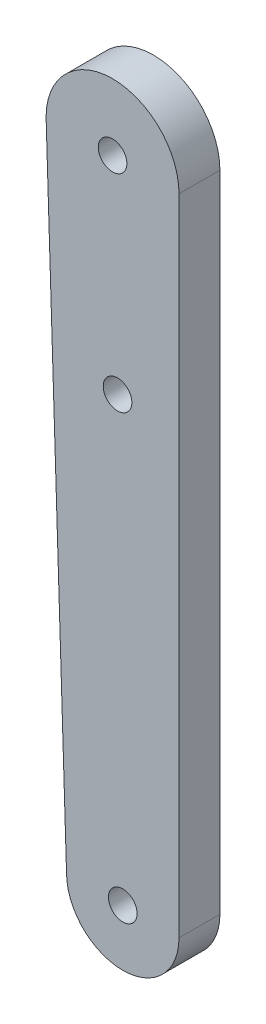
ISO-10303-21;
HEADER;
FILE_DESCRIPTION(('STEP AP214'),'2;1');
FILE_NAME('part.step','',(''),(''),'','','');
FILE_SCHEMA(('AUTOMOTIVE_DESIGN { 1 0 10303 214 1 1 1 1 }'));
ENDSEC;
DATA;
#1=APPLICATION_CONTEXT('core data for automotive mechanical design processes');
#2=APPLICATION_PROTOCOL_DEFINITION('international standard','automotive_design',2000,#1);
#3=PRODUCT_CONTEXT('',#1,'mechanical');
#4=PRODUCT('Part','Part','',(#3));
#5=PRODUCT_RELATED_PRODUCT_CATEGORY('part','',(#4));
#6=PRODUCT_DEFINITION_FORMATION('','',#4);
#7=PRODUCT_DEFINITION_CONTEXT('part definition',#1,'design');
#8=PRODUCT_DEFINITION('design','',#6,#7);
#9=PRODUCT_DEFINITION_SHAPE('','',#8);
#10=(LENGTH_UNIT() NAMED_UNIT(*) SI_UNIT(.MILLI.,.METRE.));
#11=(NAMED_UNIT(*) PLANE_ANGLE_UNIT() SI_UNIT($,.RADIAN.));
#12=(NAMED_UNIT(*) SI_UNIT($,.STERADIAN.) SOLID_ANGLE_UNIT());
#13=UNCERTAINTY_MEASURE_WITH_UNIT(LENGTH_MEASURE(1.E-05),#10,'distance_accuracy_value','');
#14=(GEOMETRIC_REPRESENTATION_CONTEXT(3) GLOBAL_UNCERTAINTY_ASSIGNED_CONTEXT((#13)) GLOBAL_UNIT_ASSIGNED_CONTEXT((#10,
#11,#12)) REPRESENTATION_CONTEXT('',''));
#15=CARTESIAN_POINT('',(0.,0.,0.));
#16=DIRECTION('',(0.,0.,1.));
#17=DIRECTION('',(1.,0.,0.));
#18=AXIS2_PLACEMENT_3D('',#15,#16,#17);
#19=CARTESIAN_POINT('',(-5.50068845938102,1.99331729577746,4.));
#20=DIRECTION('',(0.,0.,1.));
#21=DIRECTION('',(1.,0.,0.));
#22=AXIS2_PLACEMENT_3D('',#19,#20,#21);
#23=PLANE('',#22);
#24=CARTESIAN_POINT('',(-5.50068845938102,1.99331729577746,4.));
#25=DIRECTION('',(0.,0.,1.));
#26=DIRECTION('',(1.,0.,0.));
#27=AXIS2_PLACEMENT_3D('',#24,#25,#26);
#28=CIRCLE('',#27,1.4);
#29=CARTESIAN_POINT('',(-4.10068845938102,1.99331729577746,4.));
#30=VERTEX_POINT('',#29);
#31=EDGE_CURVE('E118',#30,#30,#28,.T.);
#32=ORIENTED_EDGE('',*,*,#31,.F.);
#33=EDGE_LOOP('',(#32));
#34=FACE_BOUND('',#33,.T.);
#35=CARTESIAN_POINT('',(-5.50068845938102,1.99331729577746,4.));
#36=DIRECTION('',(0.,0.,1.));
#37=DIRECTION('',(1.,0.,0.));
#38=AXIS2_PLACEMENT_3D('',#35,#36,#37);
#39=CIRCLE('',#38,5.5);
#40=CARTESIAN_POINT('',(-11.000688459381,1.99331729577745,4.));
#41=VERTEX_POINT('',#40);
#42=CARTESIAN_POINT('',(-0.000688459381021567,1.99331729577744,4.));
#43=VERTEX_POINT('',#42);
#44=EDGE_CURVE('E88',#41,#43,#39,.T.);
#45=ORIENTED_EDGE('',*,*,#44,.T.);
#46=DIRECTION('',(0.,1.,0.));
#47=VECTOR('',#46,1.);
#48=CARTESIAN_POINT('',(-0.000688459381021567,1.99331729577744,4.));
#49=LINE('',#48,#47);
#50=CARTESIAN_POINT('',(-0.000688459380886186,65.0160917207258,4.));
#51=VERTEX_POINT('',#50);
#52=EDGE_CURVE('E83',#43,#51,#49,.T.);
#53=ORIENTED_EDGE('',*,*,#52,.T.);
#54=CARTESIAN_POINT('',(-6.50068845938089,65.0160917207258,4.));
#55=DIRECTION('',(0.,0.,1.));
#56=DIRECTION('',(1.,0.,0.));
#57=AXIS2_PLACEMENT_3D('',#54,#55,#56);
#58=CIRCLE('',#57,6.5);
#59=CARTESIAN_POINT('',(-13.0006884593809,65.0160917207258,4.));
#60=VERTEX_POINT('',#59);
#61=EDGE_CURVE('E86',#51,#60,#58,.T.);
#62=ORIENTED_EDGE('',*,*,#61,.T.);
#63=DIRECTION('',(0.0317185921435704,-0.999496838870654,0.));
#64=VECTOR('',#63,1.);
#65=CARTESIAN_POINT('',(-13.0006884593809,65.0160917207258,4.));
#66=LINE('',#65,#64);
#67=EDGE_CURVE('E53',#60,#41,#66,.T.);
#68=ORIENTED_EDGE('',*,*,#67,.T.);
#69=EDGE_LOOP('',(#45,#53,#62,#68));
#70=FACE_BOUND('',#69,.T.);
#71=CARTESIAN_POINT('',(-6.50068845938089,65.0160917207258,4.));
#72=DIRECTION('',(0.,0.,1.));
#73=DIRECTION('',(1.,0.,0.));
#74=AXIS2_PLACEMENT_3D('',#71,#72,#73);
#75=CIRCLE('',#74,1.4);
#76=CARTESIAN_POINT('',(-5.10068845938089,65.0160917207258,4.));
#77=VERTEX_POINT('',#76);
#78=EDGE_CURVE('E103',#77,#77,#75,.T.);
#79=ORIENTED_EDGE('',*,*,#78,.F.);
#80=EDGE_LOOP('',(#79));
#81=FACE_BOUND('',#80,.T.);
#82=CARTESIAN_POINT('',(-6.01275635098238,45.0160917207258,4.));
#83=DIRECTION('',(0.,0.,1.));
#84=DIRECTION('',(1.,0.,0.));
#85=AXIS2_PLACEMENT_3D('',#82,#83,#84);
#86=CIRCLE('',#85,1.4);
#87=CARTESIAN_POINT('',(-4.61275635098238,45.0160917207258,4.));
#88=VERTEX_POINT('',#87);
#89=EDGE_CURVE('E124',#88,#88,#86,.T.);
#90=ORIENTED_EDGE('',*,*,#89,.F.);
#91=EDGE_LOOP('',(#90));
#92=FACE_BOUND('',#91,.T.);
#93=ADVANCED_FACE('F36',(#34,#70,#81,#92),#23,.T.);
#94=CARTESIAN_POINT('',(-5.50068845938102,1.99331729577746,0.));
#95=DIRECTION('',(0.,0.,1.));
#96=DIRECTION('',(1.,0.,0.));
#97=AXIS2_PLACEMENT_3D('',#94,#95,#96);
#98=PLANE('',#97);
#99=CARTESIAN_POINT('',(-5.50068845938102,1.99331729577746,0.));
#100=DIRECTION('',(0.,0.,1.));
#101=DIRECTION('',(1.,0.,0.));
#102=AXIS2_PLACEMENT_3D('',#99,#100,#101);
#103=CIRCLE('',#102,5.5);
#104=CARTESIAN_POINT('',(-11.000688459381,1.99331729577745,0.));
#105=VERTEX_POINT('',#104);
#106=CARTESIAN_POINT('',(-0.000688459381021567,1.99331729577744,0.));
#107=VERTEX_POINT('',#106);
#108=EDGE_CURVE('E100',#105,#107,#103,.T.);
#109=ORIENTED_EDGE('',*,*,#108,.F.);
#110=DIRECTION('',(0.0317185921435704,-0.999496838870654,0.));
#111=VECTOR('',#110,1.);
#112=CARTESIAN_POINT('',(-13.0006884593809,65.0160917207258,0.));
#113=LINE('',#112,#111);
#114=CARTESIAN_POINT('',(-13.0006884593809,65.0160917207258,0.));
#115=VERTEX_POINT('',#114);
#116=EDGE_CURVE('E76',#115,#105,#113,.T.);
#117=ORIENTED_EDGE('',*,*,#116,.F.);
#118=CARTESIAN_POINT('',(-6.50068845938089,65.0160917207258,0.));
#119=DIRECTION('',(0.,0.,1.));
#120=DIRECTION('',(1.,0.,0.));
#121=AXIS2_PLACEMENT_3D('',#118,#119,#120);
#122=CIRCLE('',#121,6.5);
#123=CARTESIAN_POINT('',(-0.000688459380886186,65.0160917207258,0.));
#124=VERTEX_POINT('',#123);
#125=EDGE_CURVE('E70',#124,#115,#122,.T.);
#126=ORIENTED_EDGE('',*,*,#125,.F.);
#127=DIRECTION('',(0.,1.,0.));
#128=VECTOR('',#127,1.);
#129=CARTESIAN_POINT('',(-0.000688459381021567,1.99331729577744,0.));
#130=LINE('',#129,#128);
#131=EDGE_CURVE('E92',#107,#124,#130,.T.);
#132=ORIENTED_EDGE('',*,*,#131,.F.);
#133=EDGE_LOOP('',(#109,#117,#126,#132));
#134=FACE_BOUND('',#133,.T.);
#135=CARTESIAN_POINT('',(-6.50068845938089,65.0160917207258,0.));
#136=DIRECTION('',(0.,0.,1.));
#137=DIRECTION('',(1.,0.,0.));
#138=AXIS2_PLACEMENT_3D('',#135,#136,#137);
#139=CIRCLE('',#138,1.4);
#140=CARTESIAN_POINT('',(-5.10068845938089,65.0160917207258,0.));
#141=VERTEX_POINT('',#140);
#142=EDGE_CURVE('E115',#141,#141,#139,.T.);
#143=ORIENTED_EDGE('',*,*,#142,.T.);
#144=EDGE_LOOP('',(#143));
#145=FACE_BOUND('',#144,.T.);
#146=CARTESIAN_POINT('',(-5.50068845938102,1.99331729577746,0.));
#147=DIRECTION('',(0.,0.,1.));
#148=DIRECTION('',(1.,0.,0.));
#149=AXIS2_PLACEMENT_3D('',#146,#147,#148);
#150=CIRCLE('',#149,1.4);
#151=CARTESIAN_POINT('',(-4.10068845938102,1.99331729577746,0.));
#152=VERTEX_POINT('',#151);
#153=EDGE_CURVE('E121',#152,#152,#150,.T.);
#154=ORIENTED_EDGE('',*,*,#153,.T.);
#155=EDGE_LOOP('',(#154));
#156=FACE_BOUND('',#155,.T.);
#157=CARTESIAN_POINT('',(-6.01275635098238,45.0160917207258,0.));
#158=DIRECTION('',(0.,0.,1.));
#159=DIRECTION('',(1.,0.,0.));
#160=AXIS2_PLACEMENT_3D('',#157,#158,#159);
#161=CIRCLE('',#160,1.4);
#162=CARTESIAN_POINT('',(-4.61275635098238,45.0160917207258,0.));
#163=VERTEX_POINT('',#162);
#164=EDGE_CURVE('E127',#163,#163,#161,.T.);
#165=ORIENTED_EDGE('',*,*,#164,.T.);
#166=EDGE_LOOP('',(#165));
#167=FACE_BOUND('',#166,.T.);
#168=ADVANCED_FACE('F111',(#134,#145,#156,#167),#98,.F.);
#169=CARTESIAN_POINT('',(-5.50068845938102,1.99331729577746,4.));
#170=DIRECTION('',(0.,0.,-1.));
#171=DIRECTION('',(-1.,0.,0.));
#172=AXIS2_PLACEMENT_3D('',#169,#170,#171);
#173=CYLINDRICAL_SURFACE('',#172,5.5);
#174=ORIENTED_EDGE('',*,*,#108,.T.);
#175=DIRECTION('',(0.,0.,-1.));
#176=VECTOR('',#175,1.);
#177=CARTESIAN_POINT('',(-0.000688459381021567,1.99331729577744,4.));
#178=LINE('',#177,#176);
#179=EDGE_CURVE('E11',#43,#107,#178,.T.);
#180=ORIENTED_EDGE('',*,*,#179,.F.);
#181=ORIENTED_EDGE('',*,*,#44,.F.);
#182=DIRECTION('',(0.,0.,-1.));
#183=VECTOR('',#182,1.);
#184=CARTESIAN_POINT('',(-11.000688459381,1.99331729577745,4.));
#185=LINE('',#184,#183);
#186=EDGE_CURVE('E96',#41,#105,#185,.T.);
#187=ORIENTED_EDGE('',*,*,#186,.T.);
#188=EDGE_LOOP('',(#174,#180,#181,#187));
#189=FACE_BOUND('',#188,.T.);
#190=ADVANCED_FACE('F38',(#189),#173,.T.);
#191=CARTESIAN_POINT('',(-0.000688459381021567,1.99331729577744,4.));
#192=DIRECTION('',(-1.,0.,0.));
#193=DIRECTION('',(0.,-1.,0.));
#194=AXIS2_PLACEMENT_3D('',#191,#192,#193);
#195=PLANE('',#194);
#196=ORIENTED_EDGE('',*,*,#131,.T.);
#197=DIRECTION('',(0.,0.,-1.));
#198=VECTOR('',#197,1.);
#199=CARTESIAN_POINT('',(-0.000688459380886186,65.0160917207258,4.));
#200=LINE('',#199,#198);
#201=EDGE_CURVE('E45',#51,#124,#200,.T.);
#202=ORIENTED_EDGE('',*,*,#201,.F.);
#203=ORIENTED_EDGE('',*,*,#52,.F.);
#204=ORIENTED_EDGE('',*,*,#179,.T.);
#205=EDGE_LOOP('',(#196,#202,#203,#204));
#206=FACE_BOUND('',#205,.T.);
#207=ADVANCED_FACE('F91',(#206),#195,.F.);
#208=CARTESIAN_POINT('',(-6.50068845938089,65.0160917207258,4.));
#209=DIRECTION('',(0.,0.,-1.));
#210=DIRECTION('',(-1.,0.,0.));
#211=AXIS2_PLACEMENT_3D('',#208,#209,#210);
#212=CYLINDRICAL_SURFACE('',#211,6.5);
#213=ORIENTED_EDGE('',*,*,#125,.T.);
#214=DIRECTION('',(0.,0.,-1.));
#215=VECTOR('',#214,1.);
#216=CARTESIAN_POINT('',(-13.0006884593809,65.0160917207258,4.));
#217=LINE('',#216,#215);
#218=EDGE_CURVE('E93',#60,#115,#217,.T.);
#219=ORIENTED_EDGE('',*,*,#218,.F.);
#220=ORIENTED_EDGE('',*,*,#61,.F.);
#221=ORIENTED_EDGE('',*,*,#201,.T.);
#222=EDGE_LOOP('',(#213,#219,#220,#221));
#223=FACE_BOUND('',#222,.T.);
#224=ADVANCED_FACE('F94',(#223),#212,.T.);
#225=CARTESIAN_POINT('',(-13.0006884593809,65.0160917207258,4.));
#226=DIRECTION('',(0.999496838870654,0.0317185921435704,0.));
#227=DIRECTION('',(-0.0317185921435704,0.999496838870654,0.));
#228=AXIS2_PLACEMENT_3D('',#225,#226,#227);
#229=PLANE('',#228);
#230=ORIENTED_EDGE('',*,*,#116,.T.);
#231=ORIENTED_EDGE('',*,*,#186,.F.);
#232=ORIENTED_EDGE('',*,*,#67,.F.);
#233=ORIENTED_EDGE('',*,*,#218,.T.);
#234=EDGE_LOOP('',(#230,#231,#232,#233));
#235=FACE_BOUND('',#234,.T.);
#236=ADVANCED_FACE('F108',(#235),#229,.F.);
#237=CARTESIAN_POINT('',(-6.50068845938089,65.0160917207258,4.));
#238=DIRECTION('',(0.,0.,-1.));
#239=DIRECTION('',(-1.,0.,0.));
#240=AXIS2_PLACEMENT_3D('',#237,#238,#239);
#241=CYLINDRICAL_SURFACE('',#240,1.4);
#242=ORIENTED_EDGE('',*,*,#78,.T.);
#243=EDGE_LOOP('',(#242));
#244=FACE_BOUND('',#243,.T.);
#245=ORIENTED_EDGE('',*,*,#142,.F.);
#246=EDGE_LOOP('',(#245));
#247=FACE_BOUND('',#246,.T.);
#248=ADVANCED_FACE('F145',(#244,#247),#241,.F.);
#249=CARTESIAN_POINT('',(-5.50068845938102,1.99331729577746,4.));
#250=DIRECTION('',(0.,0.,-1.));
#251=DIRECTION('',(-1.,0.,0.));
#252=AXIS2_PLACEMENT_3D('',#249,#250,#251);
#253=CYLINDRICAL_SURFACE('',#252,1.4);
#254=ORIENTED_EDGE('',*,*,#31,.T.);
#255=EDGE_LOOP('',(#254));
#256=FACE_BOUND('',#255,.T.);
#257=ORIENTED_EDGE('',*,*,#153,.F.);
#258=EDGE_LOOP('',(#257));
#259=FACE_BOUND('',#258,.T.);
#260=ADVANCED_FACE('F191',(#256,#259),#253,.F.);
#261=CARTESIAN_POINT('',(-6.01275635098238,45.0160917207258,4.));
#262=DIRECTION('',(0.,0.,-1.));
#263=DIRECTION('',(-1.,0.,0.));
#264=AXIS2_PLACEMENT_3D('',#261,#262,#263);
#265=CYLINDRICAL_SURFACE('',#264,1.4);
#266=ORIENTED_EDGE('',*,*,#89,.T.);
#267=EDGE_LOOP('',(#266));
#268=FACE_BOUND('',#267,.T.);
#269=ORIENTED_EDGE('',*,*,#164,.F.);
#270=EDGE_LOOP('',(#269));
#271=FACE_BOUND('',#270,.T.);
#272=ADVANCED_FACE('F133',(#268,#271),#265,.F.);
#273=CLOSED_SHELL('',(#93,#168,#190,#207,#224,#236,#248,#260,#272));
#274=MANIFOLD_SOLID_BREP('B2',#273);
#275=ADVANCED_BREP_SHAPE_REPRESENTATION('',(#18,#274),#14);
#276=SHAPE_DEFINITION_REPRESENTATION(#9,#275);
ENDSEC;
END-ISO-10303-21;
